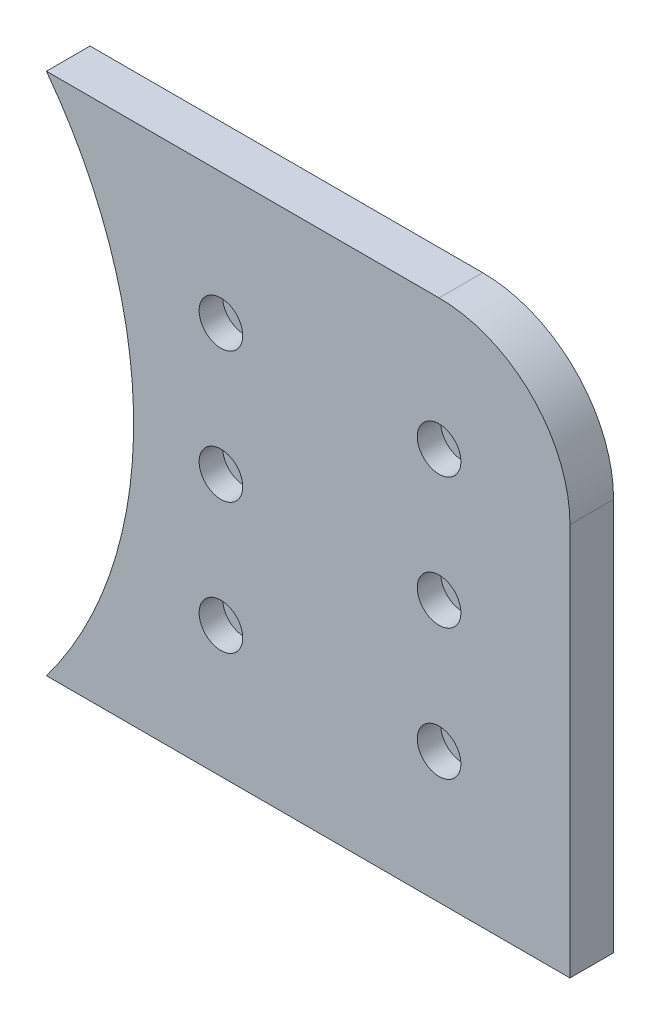
ISO-10303-21;
HEADER;
FILE_DESCRIPTION(('STEP AP214'),'2;1');
FILE_NAME('part.step','',(''),(''),'','','');
FILE_SCHEMA(('AUTOMOTIVE_DESIGN { 1 0 10303 214 1 1 1 1 }'));
ENDSEC;
DATA;
#1=APPLICATION_CONTEXT('core data for automotive mechanical design processes');
#2=APPLICATION_PROTOCOL_DEFINITION('international standard','automotive_design',2000,#1);
#3=PRODUCT_CONTEXT('',#1,'mechanical');
#4=PRODUCT('Part','Part','',(#3));
#5=PRODUCT_RELATED_PRODUCT_CATEGORY('part','',(#4));
#6=PRODUCT_DEFINITION_FORMATION('','',#4);
#7=PRODUCT_DEFINITION_CONTEXT('part definition',#1,'design');
#8=PRODUCT_DEFINITION('design','',#6,#7);
#9=PRODUCT_DEFINITION_SHAPE('','',#8);
#10=(LENGTH_UNIT() NAMED_UNIT(*) SI_UNIT(.MILLI.,.METRE.));
#11=(NAMED_UNIT(*) PLANE_ANGLE_UNIT() SI_UNIT($,.RADIAN.));
#12=(NAMED_UNIT(*) SI_UNIT($,.STERADIAN.) SOLID_ANGLE_UNIT());
#13=UNCERTAINTY_MEASURE_WITH_UNIT(LENGTH_MEASURE(1.E-05),#10,'distance_accuracy_value','');
#14=(GEOMETRIC_REPRESENTATION_CONTEXT(3) GLOBAL_UNCERTAINTY_ASSIGNED_CONTEXT((#13)) GLOBAL_UNIT_ASSIGNED_CONTEXT((#10,
#11,#12)) REPRESENTATION_CONTEXT('',''));
#15=CARTESIAN_POINT('',(0.,0.,0.));
#16=DIRECTION('',(0.,0.,1.));
#17=DIRECTION('',(1.,0.,0.));
#18=AXIS2_PLACEMENT_3D('',#15,#16,#17);
#19=CARTESIAN_POINT('',(-200.,0.,5.));
#20=DIRECTION('',(0.,0.,-1.));
#21=DIRECTION('',(-1.,0.,0.));
#22=AXIS2_PLACEMENT_3D('',#19,#20,#21);
#23=CYLINDRICAL_SURFACE('',#22,100.);
#24=CARTESIAN_POINT('',(-200.,0.,-5.));
#25=DIRECTION('',(0.,0.,-1.));
#26=DIRECTION('',(-1.,0.,0.));
#27=AXIS2_PLACEMENT_3D('',#24,#25,#26);
#28=CIRCLE('',#27,100.);
#29=CARTESIAN_POINT('',(-120.,60.,-5.));
#30=VERTEX_POINT('',#29);
#31=CARTESIAN_POINT('',(-120.,-60.,-5.));
#32=VERTEX_POINT('',#31);
#33=EDGE_CURVE('E105',#30,#32,#28,.T.);
#34=ORIENTED_EDGE('',*,*,#33,.T.);
#35=DIRECTION('',(0.,0.,-1.));
#36=VECTOR('',#35,1.);
#37=CARTESIAN_POINT('',(-120.,-60.,5.));
#38=LINE('',#37,#36);
#39=CARTESIAN_POINT('',(-120.,-60.,5.));
#40=VERTEX_POINT('',#39);
#41=EDGE_CURVE('E86',#40,#32,#38,.T.);
#42=ORIENTED_EDGE('',*,*,#41,.F.);
#43=CARTESIAN_POINT('',(-200.,0.,5.));
#44=DIRECTION('',(0.,0.,-1.));
#45=DIRECTION('',(-1.,0.,0.));
#46=AXIS2_PLACEMENT_3D('',#43,#44,#45);
#47=CIRCLE('',#46,100.);
#48=CARTESIAN_POINT('',(-120.,60.,5.));
#49=VERTEX_POINT('',#48);
#50=EDGE_CURVE('E92',#49,#40,#47,.T.);
#51=ORIENTED_EDGE('',*,*,#50,.F.);
#52=DIRECTION('',(0.,0.,-1.));
#53=VECTOR('',#52,1.);
#54=CARTESIAN_POINT('',(-120.,60.,5.));
#55=LINE('',#54,#53);
#56=EDGE_CURVE('E110',#49,#30,#55,.T.);
#57=ORIENTED_EDGE('',*,*,#56,.T.);
#58=EDGE_LOOP('',(#34,#42,#51,#57));
#59=FACE_BOUND('',#58,.T.);
#60=ADVANCED_FACE('F33',(#59),#23,.F.);
#61=CARTESIAN_POINT('',(-120.,-60.,5.));
#62=DIRECTION('',(0.,1.,0.));
#63=DIRECTION('',(0.,0.,1.));
#64=AXIS2_PLACEMENT_3D('',#61,#62,#63);
#65=PLANE('',#64);
#66=DIRECTION('',(1.,0.,0.));
#67=VECTOR('',#66,1.);
#68=CARTESIAN_POINT('',(-120.,-60.,-5.));
#69=LINE('',#68,#67);
#70=CARTESIAN_POINT('',(0.,-60.,-5.));
#71=VERTEX_POINT('',#70);
#72=EDGE_CURVE('E375',#32,#71,#69,.T.);
#73=ORIENTED_EDGE('',*,*,#72,.T.);
#74=DIRECTION('',(0.,0.,-1.));
#75=VECTOR('',#74,1.);
#76=CARTESIAN_POINT('',(0.,-60.,5.));
#77=LINE('',#76,#75);
#78=CARTESIAN_POINT('',(0.,-60.,5.));
#79=VERTEX_POINT('',#78);
#80=EDGE_CURVE('E89',#79,#71,#77,.T.);
#81=ORIENTED_EDGE('',*,*,#80,.F.);
#82=DIRECTION('',(1.,0.,0.));
#83=VECTOR('',#82,1.);
#84=CARTESIAN_POINT('',(-120.,-60.,5.));
#85=LINE('',#84,#83);
#86=EDGE_CURVE('E82',#40,#79,#85,.T.);
#87=ORIENTED_EDGE('',*,*,#86,.F.);
#88=ORIENTED_EDGE('',*,*,#41,.T.);
#89=EDGE_LOOP('',(#73,#81,#87,#88));
#90=FACE_BOUND('',#89,.T.);
#91=ADVANCED_FACE('F84',(#90),#65,.F.);
#92=CARTESIAN_POINT('',(0.,60.,5.));
#93=DIRECTION('',(-1.,0.,0.));
#94=DIRECTION('',(0.,0.,1.));
#95=AXIS2_PLACEMENT_3D('',#92,#93,#94);
#96=PLANE('',#95);
#97=DIRECTION('',(0.,1.,0.));
#98=VECTOR('',#97,1.);
#99=CARTESIAN_POINT('',(0.,60.,-5.));
#100=LINE('',#99,#98);
#101=CARTESIAN_POINT('',(0.,30.,-5.));
#102=VERTEX_POINT('',#101);
#103=EDGE_CURVE('E374',#71,#102,#100,.T.);
#104=ORIENTED_EDGE('',*,*,#103,.T.);
#105=DIRECTION('',(0.,0.,-1.));
#106=VECTOR('',#105,1.);
#107=CARTESIAN_POINT('',(0.,30.,5.));
#108=LINE('',#107,#106);
#109=CARTESIAN_POINT('',(0.,30.,5.));
#110=VERTEX_POINT('',#109);
#111=EDGE_CURVE('E48',#102,#110,#108,.F.);
#112=ORIENTED_EDGE('',*,*,#111,.T.);
#113=DIRECTION('',(0.,1.,0.));
#114=VECTOR('',#113,1.);
#115=CARTESIAN_POINT('',(0.,60.,5.));
#116=LINE('',#115,#114);
#117=EDGE_CURVE('E91',#79,#110,#116,.T.);
#118=ORIENTED_EDGE('',*,*,#117,.F.);
#119=ORIENTED_EDGE('',*,*,#80,.T.);
#120=EDGE_LOOP('',(#104,#112,#118,#119));
#121=FACE_BOUND('',#120,.T.);
#122=ADVANCED_FACE('F186',(#121),#96,.F.);
#123=CARTESIAN_POINT('',(-120.,60.,5.));
#124=DIRECTION('',(0.,-1.,0.));
#125=DIRECTION('',(0.,0.,-1.));
#126=AXIS2_PLACEMENT_3D('',#123,#124,#125);
#127=PLANE('',#126);
#128=DIRECTION('',(-1.,0.,0.));
#129=VECTOR('',#128,1.);
#130=CARTESIAN_POINT('',(-120.,60.,5.));
#131=LINE('',#130,#129);
#132=CARTESIAN_POINT('',(-30.,60.,5.));
#133=VERTEX_POINT('',#132);
#134=EDGE_CURVE('E98',#133,#49,#131,.T.);
#135=ORIENTED_EDGE('',*,*,#134,.F.);
#136=DIRECTION('',(0.,0.,-1.));
#137=VECTOR('',#136,1.);
#138=CARTESIAN_POINT('',(-30.,60.,5.));
#139=LINE('',#138,#137);
#140=CARTESIAN_POINT('',(-30.,60.,-5.));
#141=VERTEX_POINT('',#140);
#142=EDGE_CURVE('E106',#133,#141,#139,.T.);
#143=ORIENTED_EDGE('',*,*,#142,.T.);
#144=DIRECTION('',(-1.,0.,0.));
#145=VECTOR('',#144,1.);
#146=CARTESIAN_POINT('',(-120.,60.,-5.));
#147=LINE('',#146,#145);
#148=EDGE_CURVE('E102',#141,#30,#147,.T.);
#149=ORIENTED_EDGE('',*,*,#148,.T.);
#150=ORIENTED_EDGE('',*,*,#56,.F.);
#151=EDGE_LOOP('',(#135,#143,#149,#150));
#152=FACE_BOUND('',#151,.T.);
#153=ADVANCED_FACE('F176',(#152),#127,.F.);
#154=CARTESIAN_POINT('',(-200.,0.,5.));
#155=DIRECTION('',(0.,0.,-1.));
#156=DIRECTION('',(-1.,0.,0.));
#157=AXIS2_PLACEMENT_3D('',#154,#155,#156);
#158=PLANE('',#157);
#159=CARTESIAN_POINT('',(-30.,0.,5.));
#160=DIRECTION('',(0.,0.,1.));
#161=DIRECTION('',(1.,0.,0.));
#162=AXIS2_PLACEMENT_3D('',#159,#160,#161);
#163=CIRCLE('',#162,5.);
#164=CARTESIAN_POINT('',(-25.,0.,5.));
#165=VERTEX_POINT('',#164);
#166=EDGE_CURVE('E434',#165,#165,#163,.T.);
#167=ORIENTED_EDGE('',*,*,#166,.F.);
#168=EDGE_LOOP('',(#167));
#169=FACE_BOUND('',#168,.T.);
#170=CARTESIAN_POINT('',(-30.,30.,5.));
#171=DIRECTION('',(0.,0.,1.));
#172=DIRECTION('',(1.,0.,0.));
#173=AXIS2_PLACEMENT_3D('',#170,#171,#172);
#174=CIRCLE('',#173,5.);
#175=CARTESIAN_POINT('',(-25.,30.,5.));
#176=VERTEX_POINT('',#175);
#177=EDGE_CURVE('E422',#176,#176,#174,.T.);
#178=ORIENTED_EDGE('',*,*,#177,.F.);
#179=EDGE_LOOP('',(#178));
#180=FACE_BOUND('',#179,.T.);
#181=ORIENTED_EDGE('',*,*,#117,.T.);
#182=CARTESIAN_POINT('',(-30.,30.,5.));
#183=DIRECTION('',(0.,0.,-1.));
#184=DIRECTION('',(-1.,0.,0.));
#185=AXIS2_PLACEMENT_3D('',#182,#183,#184);
#186=CIRCLE('',#185,30.);
#187=EDGE_CURVE('E116',#110,#133,#186,.F.);
#188=ORIENTED_EDGE('',*,*,#187,.T.);
#189=ORIENTED_EDGE('',*,*,#134,.T.);
#190=ORIENTED_EDGE('',*,*,#50,.T.);
#191=ORIENTED_EDGE('',*,*,#86,.T.);
#192=EDGE_LOOP('',(#181,#188,#189,#190,#191));
#193=FACE_BOUND('',#192,.T.);
#194=CARTESIAN_POINT('',(-30.,-30.,5.));
#195=DIRECTION('',(0.,0.,1.));
#196=DIRECTION('',(1.,0.,0.));
#197=AXIS2_PLACEMENT_3D('',#194,#195,#196);
#198=CIRCLE('',#197,5.);
#199=CARTESIAN_POINT('',(-25.,-30.,5.));
#200=VERTEX_POINT('',#199);
#201=EDGE_CURVE('E118',#200,#200,#198,.T.);
#202=ORIENTED_EDGE('',*,*,#201,.F.);
#203=EDGE_LOOP('',(#202));
#204=FACE_BOUND('',#203,.T.);
#205=CARTESIAN_POINT('',(-80.,30.,5.));
#206=DIRECTION('',(0.,0.,1.));
#207=DIRECTION('',(1.,0.,0.));
#208=AXIS2_PLACEMENT_3D('',#205,#206,#207);
#209=CIRCLE('',#208,5.);
#210=CARTESIAN_POINT('',(-75.,30.,5.));
#211=VERTEX_POINT('',#210);
#212=EDGE_CURVE('E130',#211,#211,#209,.T.);
#213=ORIENTED_EDGE('',*,*,#212,.F.);
#214=EDGE_LOOP('',(#213));
#215=FACE_BOUND('',#214,.T.);
#216=CARTESIAN_POINT('',(-80.,0.,5.));
#217=DIRECTION('',(0.,0.,1.));
#218=DIRECTION('',(1.,0.,0.));
#219=AXIS2_PLACEMENT_3D('',#216,#217,#218);
#220=CIRCLE('',#219,5.);
#221=CARTESIAN_POINT('',(-75.,0.,5.));
#222=VERTEX_POINT('',#221);
#223=EDGE_CURVE('E142',#222,#222,#220,.T.);
#224=ORIENTED_EDGE('',*,*,#223,.F.);
#225=EDGE_LOOP('',(#224));
#226=FACE_BOUND('',#225,.T.);
#227=CARTESIAN_POINT('',(-80.,-30.,5.));
#228=DIRECTION('',(0.,0.,1.));
#229=DIRECTION('',(1.,0.,0.));
#230=AXIS2_PLACEMENT_3D('',#227,#228,#229);
#231=CIRCLE('',#230,5.);
#232=CARTESIAN_POINT('',(-75.,-30.,5.));
#233=VERTEX_POINT('',#232);
#234=EDGE_CURVE('E154',#233,#233,#231,.T.);
#235=ORIENTED_EDGE('',*,*,#234,.F.);
#236=EDGE_LOOP('',(#235));
#237=FACE_BOUND('',#236,.T.);
#238=ADVANCED_FACE('F95',(#169,#180,#193,#204,#215,#226,#237),#158,.F.);
#239=CARTESIAN_POINT('',(-200.,0.,-5.));
#240=DIRECTION('',(0.,0.,-1.));
#241=DIRECTION('',(-1.,0.,0.));
#242=AXIS2_PLACEMENT_3D('',#239,#240,#241);
#243=PLANE('',#242);
#244=CARTESIAN_POINT('',(-30.,0.,-5.));
#245=DIRECTION('',(0.,0.,1.));
#246=DIRECTION('',(1.,0.,0.));
#247=AXIS2_PLACEMENT_3D('',#244,#245,#246);
#248=CIRCLE('',#247,2.65);
#249=CARTESIAN_POINT('',(-27.35,0.,-5.));
#250=VERTEX_POINT('',#249);
#251=EDGE_CURVE('E431',#250,#250,#248,.T.);
#252=ORIENTED_EDGE('',*,*,#251,.T.);
#253=EDGE_LOOP('',(#252));
#254=FACE_BOUND('',#253,.T.);
#255=CARTESIAN_POINT('',(-30.,30.,-5.));
#256=DIRECTION('',(0.,0.,1.));
#257=DIRECTION('',(1.,0.,0.));
#258=AXIS2_PLACEMENT_3D('',#255,#256,#257);
#259=CIRCLE('',#258,2.65);
#260=CARTESIAN_POINT('',(-27.35,30.,-5.));
#261=VERTEX_POINT('',#260);
#262=EDGE_CURVE('E383',#261,#261,#259,.T.);
#263=ORIENTED_EDGE('',*,*,#262,.T.);
#264=EDGE_LOOP('',(#263));
#265=FACE_BOUND('',#264,.T.);
#266=ORIENTED_EDGE('',*,*,#148,.F.);
#267=CARTESIAN_POINT('',(-30.,30.,-5.));
#268=DIRECTION('',(0.,0.,-1.));
#269=DIRECTION('',(-1.,0.,0.));
#270=AXIS2_PLACEMENT_3D('',#267,#268,#269);
#271=CIRCLE('',#270,30.);
#272=EDGE_CURVE('E56',#141,#102,#271,.T.);
#273=ORIENTED_EDGE('',*,*,#272,.T.);
#274=ORIENTED_EDGE('',*,*,#103,.F.);
#275=ORIENTED_EDGE('',*,*,#72,.F.);
#276=ORIENTED_EDGE('',*,*,#33,.F.);
#277=EDGE_LOOP('',(#266,#273,#274,#275,#276));
#278=FACE_BOUND('',#277,.T.);
#279=CARTESIAN_POINT('',(-30.,-30.,-5.));
#280=DIRECTION('',(0.,0.,1.));
#281=DIRECTION('',(1.,0.,0.));
#282=AXIS2_PLACEMENT_3D('',#279,#280,#281);
#283=CIRCLE('',#282,2.65);
#284=CARTESIAN_POINT('',(-27.35,-30.,-5.));
#285=VERTEX_POINT('',#284);
#286=EDGE_CURVE('E121',#285,#285,#283,.T.);
#287=ORIENTED_EDGE('',*,*,#286,.T.);
#288=EDGE_LOOP('',(#287));
#289=FACE_BOUND('',#288,.T.);
#290=CARTESIAN_POINT('',(-80.,30.,-5.));
#291=DIRECTION('',(0.,0.,1.));
#292=DIRECTION('',(1.,0.,0.));
#293=AXIS2_PLACEMENT_3D('',#290,#291,#292);
#294=CIRCLE('',#293,2.65);
#295=CARTESIAN_POINT('',(-77.35,30.,-5.));
#296=VERTEX_POINT('',#295);
#297=EDGE_CURVE('E133',#296,#296,#294,.T.);
#298=ORIENTED_EDGE('',*,*,#297,.T.);
#299=EDGE_LOOP('',(#298));
#300=FACE_BOUND('',#299,.T.);
#301=CARTESIAN_POINT('',(-80.,0.,-5.));
#302=DIRECTION('',(0.,0.,1.));
#303=DIRECTION('',(1.,0.,0.));
#304=AXIS2_PLACEMENT_3D('',#301,#302,#303);
#305=CIRCLE('',#304,2.65);
#306=CARTESIAN_POINT('',(-77.35,0.,-5.));
#307=VERTEX_POINT('',#306);
#308=EDGE_CURVE('E145',#307,#307,#305,.T.);
#309=ORIENTED_EDGE('',*,*,#308,.T.);
#310=EDGE_LOOP('',(#309));
#311=FACE_BOUND('',#310,.T.);
#312=CARTESIAN_POINT('',(-80.,-30.,-5.));
#313=DIRECTION('',(0.,0.,1.));
#314=DIRECTION('',(1.,0.,0.));
#315=AXIS2_PLACEMENT_3D('',#312,#313,#314);
#316=CIRCLE('',#315,2.65);
#317=CARTESIAN_POINT('',(-77.35,-30.,-5.));
#318=VERTEX_POINT('',#317);
#319=EDGE_CURVE('E157',#318,#318,#316,.T.);
#320=ORIENTED_EDGE('',*,*,#319,.T.);
#321=EDGE_LOOP('',(#320));
#322=FACE_BOUND('',#321,.T.);
#323=ADVANCED_FACE('F175',(#254,#265,#278,#289,#300,#311,#322),#243,.T.);
#324=CARTESIAN_POINT('',(-30.,30.,5.));
#325=DIRECTION('',(0.,0.,-1.));
#326=DIRECTION('',(-1.,0.,0.));
#327=AXIS2_PLACEMENT_3D('',#324,#325,#326);
#328=CYLINDRICAL_SURFACE('',#327,30.);
#329=ORIENTED_EDGE('',*,*,#187,.F.);
#330=ORIENTED_EDGE('',*,*,#111,.F.);
#331=ORIENTED_EDGE('',*,*,#272,.F.);
#332=ORIENTED_EDGE('',*,*,#142,.F.);
#333=EDGE_LOOP('',(#329,#330,#331,#332));
#334=FACE_BOUND('',#333,.T.);
#335=ADVANCED_FACE('F183',(#334),#328,.T.);
#336=CARTESIAN_POINT('',(-30.,30.,5.));
#337=DIRECTION('',(0.,0.,1.));
#338=DIRECTION('',(1.,0.,0.));
#339=AXIS2_PLACEMENT_3D('',#336,#337,#338);
#340=CYLINDRICAL_SURFACE('',#339,2.65);
#341=ORIENTED_EDGE('',*,*,#262,.F.);
#342=EDGE_LOOP('',(#341));
#343=FACE_BOUND('',#342,.T.);
#344=CARTESIAN_POINT('',(-30.,30.,-0.4));
#345=DIRECTION('',(0.,0.,1.));
#346=DIRECTION('',(1.,0.,0.));
#347=AXIS2_PLACEMENT_3D('',#344,#345,#346);
#348=CIRCLE('',#347,2.65);
#349=CARTESIAN_POINT('',(-27.35,30.,-0.4));
#350=VERTEX_POINT('',#349);
#351=EDGE_CURVE('E412',#350,#350,#348,.T.);
#352=ORIENTED_EDGE('',*,*,#351,.T.);
#353=EDGE_LOOP('',(#352));
#354=FACE_BOUND('',#353,.T.);
#355=ADVANCED_FACE('F202',(#343,#354),#340,.F.);
#356=CARTESIAN_POINT('',(-27.35,30.,-0.4));
#357=DIRECTION('',(0.,0.,-1.));
#358=DIRECTION('',(-1.,0.,0.));
#359=AXIS2_PLACEMENT_3D('',#356,#357,#358);
#360=PLANE('',#359);
#361=ORIENTED_EDGE('',*,*,#351,.F.);
#362=EDGE_LOOP('',(#361));
#363=FACE_BOUND('',#362,.T.);
#364=CARTESIAN_POINT('',(-30.,30.,-0.4));
#365=DIRECTION('',(0.,0.,1.));
#366=DIRECTION('',(1.,0.,0.));
#367=AXIS2_PLACEMENT_3D('',#364,#365,#366);
#368=CIRCLE('',#367,5.);
#369=CARTESIAN_POINT('',(-25.,30.,-0.4));
#370=VERTEX_POINT('',#369);
#371=EDGE_CURVE('E417',#370,#370,#368,.T.);
#372=ORIENTED_EDGE('',*,*,#371,.T.);
#373=EDGE_LOOP('',(#372));
#374=FACE_BOUND('',#373,.T.);
#375=ADVANCED_FACE('F321',(#363,#374),#360,.F.);
#376=CARTESIAN_POINT('',(-30.,30.,5.));
#377=DIRECTION('',(0.,0.,1.));
#378=DIRECTION('',(1.,0.,0.));
#379=AXIS2_PLACEMENT_3D('',#376,#377,#378);
#380=CYLINDRICAL_SURFACE('',#379,5.);
#381=ORIENTED_EDGE('',*,*,#371,.F.);
#382=EDGE_LOOP('',(#381));
#383=FACE_BOUND('',#382,.T.);
#384=ORIENTED_EDGE('',*,*,#177,.T.);
#385=EDGE_LOOP('',(#384));
#386=FACE_BOUND('',#385,.T.);
#387=ADVANCED_FACE('F312',(#383,#386),#380,.F.);
#388=CARTESIAN_POINT('',(-30.,0.,5.));
#389=DIRECTION('',(0.,0.,1.));
#390=DIRECTION('',(1.,0.,0.));
#391=AXIS2_PLACEMENT_3D('',#388,#389,#390);
#392=CYLINDRICAL_SURFACE('',#391,2.65);
#393=ORIENTED_EDGE('',*,*,#251,.F.);
#394=EDGE_LOOP('',(#393));
#395=FACE_BOUND('',#394,.T.);
#396=CARTESIAN_POINT('',(-30.,0.,-0.4));
#397=DIRECTION('',(0.,0.,1.));
#398=DIRECTION('',(1.,0.,0.));
#399=AXIS2_PLACEMENT_3D('',#396,#397,#398);
#400=CIRCLE('',#399,2.65);
#401=CARTESIAN_POINT('',(-27.35,0.,-0.4));
#402=VERTEX_POINT('',#401);
#403=EDGE_CURVE('E425',#402,#402,#400,.T.);
#404=ORIENTED_EDGE('',*,*,#403,.T.);
#405=EDGE_LOOP('',(#404));
#406=FACE_BOUND('',#405,.T.);
#407=ADVANCED_FACE('F304',(#395,#406),#392,.F.);
#408=CARTESIAN_POINT('',(-27.35,0.,-0.4));
#409=DIRECTION('',(0.,0.,-1.));
#410=DIRECTION('',(-1.,0.,0.));
#411=AXIS2_PLACEMENT_3D('',#408,#409,#410);
#412=PLANE('',#411);
#413=ORIENTED_EDGE('',*,*,#403,.F.);
#414=EDGE_LOOP('',(#413));
#415=FACE_BOUND('',#414,.T.);
#416=CARTESIAN_POINT('',(-30.,0.,-0.4));
#417=DIRECTION('',(0.,0.,1.));
#418=DIRECTION('',(1.,0.,0.));
#419=AXIS2_PLACEMENT_3D('',#416,#417,#418);
#420=CIRCLE('',#419,5.);
#421=CARTESIAN_POINT('',(-25.,0.,-0.4));
#422=VERTEX_POINT('',#421);
#423=EDGE_CURVE('E428',#422,#422,#420,.T.);
#424=ORIENTED_EDGE('',*,*,#423,.T.);
#425=EDGE_LOOP('',(#424));
#426=FACE_BOUND('',#425,.T.);
#427=ADVANCED_FACE('F296',(#415,#426),#412,.F.);
#428=CARTESIAN_POINT('',(-30.,0.,5.));
#429=DIRECTION('',(0.,0.,1.));
#430=DIRECTION('',(1.,0.,0.));
#431=AXIS2_PLACEMENT_3D('',#428,#429,#430);
#432=CYLINDRICAL_SURFACE('',#431,5.);
#433=ORIENTED_EDGE('',*,*,#423,.F.);
#434=EDGE_LOOP('',(#433));
#435=FACE_BOUND('',#434,.T.);
#436=ORIENTED_EDGE('',*,*,#166,.T.);
#437=EDGE_LOOP('',(#436));
#438=FACE_BOUND('',#437,.T.);
#439=ADVANCED_FACE('F216',(#435,#438),#432,.F.);
#440=CARTESIAN_POINT('',(-30.,-30.,5.));
#441=DIRECTION('',(0.,0.,1.));
#442=DIRECTION('',(1.,0.,0.));
#443=AXIS2_PLACEMENT_3D('',#440,#441,#442);
#444=CYLINDRICAL_SURFACE('',#443,5.);
#445=CARTESIAN_POINT('',(-30.,-30.,-0.4));
#446=DIRECTION('',(0.,0.,1.));
#447=DIRECTION('',(1.,0.,0.));
#448=AXIS2_PLACEMENT_3D('',#445,#446,#447);
#449=CIRCLE('',#448,5.);
#450=CARTESIAN_POINT('',(-25.,-30.,-0.4));
#451=VERTEX_POINT('',#450);
#452=EDGE_CURVE('E127',#451,#451,#449,.T.);
#453=ORIENTED_EDGE('',*,*,#452,.F.);
#454=EDGE_LOOP('',(#453));
#455=FACE_BOUND('',#454,.T.);
#456=ORIENTED_EDGE('',*,*,#201,.T.);
#457=EDGE_LOOP('',(#456));
#458=FACE_BOUND('',#457,.T.);
#459=ADVANCED_FACE('F212',(#455,#458),#444,.F.);
#460=CARTESIAN_POINT('',(-27.35,-30.,-0.4));
#461=DIRECTION('',(0.,0.,-1.));
#462=DIRECTION('',(-1.,0.,0.));
#463=AXIS2_PLACEMENT_3D('',#460,#461,#462);
#464=PLANE('',#463);
#465=CARTESIAN_POINT('',(-30.,-30.,-0.4));
#466=DIRECTION('',(0.,0.,1.));
#467=DIRECTION('',(1.,0.,0.));
#468=AXIS2_PLACEMENT_3D('',#465,#466,#467);
#469=CIRCLE('',#468,2.65);
#470=CARTESIAN_POINT('',(-27.35,-30.,-0.4));
#471=VERTEX_POINT('',#470);
#472=EDGE_CURVE('E124',#471,#471,#469,.T.);
#473=ORIENTED_EDGE('',*,*,#472,.F.);
#474=EDGE_LOOP('',(#473));
#475=FACE_BOUND('',#474,.T.);
#476=ORIENTED_EDGE('',*,*,#452,.T.);
#477=EDGE_LOOP('',(#476));
#478=FACE_BOUND('',#477,.T.);
#479=ADVANCED_FACE('F208',(#475,#478),#464,.F.);
#480=CARTESIAN_POINT('',(-30.,-30.,5.));
#481=DIRECTION('',(0.,0.,1.));
#482=DIRECTION('',(1.,0.,0.));
#483=AXIS2_PLACEMENT_3D('',#480,#481,#482);
#484=CYLINDRICAL_SURFACE('',#483,2.65);
#485=ORIENTED_EDGE('',*,*,#286,.F.);
#486=EDGE_LOOP('',(#485));
#487=FACE_BOUND('',#486,.T.);
#488=ORIENTED_EDGE('',*,*,#472,.T.);
#489=EDGE_LOOP('',(#488));
#490=FACE_BOUND('',#489,.T.);
#491=ADVANCED_FACE('F204',(#487,#490),#484,.F.);
#492=CARTESIAN_POINT('',(-80.,30.,5.));
#493=DIRECTION('',(0.,0.,1.));
#494=DIRECTION('',(1.,0.,0.));
#495=AXIS2_PLACEMENT_3D('',#492,#493,#494);
#496=CYLINDRICAL_SURFACE('',#495,5.);
#497=CARTESIAN_POINT('',(-80.,30.,-0.4));
#498=DIRECTION('',(0.,0.,1.));
#499=DIRECTION('',(1.,0.,0.));
#500=AXIS2_PLACEMENT_3D('',#497,#498,#499);
#501=CIRCLE('',#500,5.);
#502=CARTESIAN_POINT('',(-75.,30.,-0.4));
#503=VERTEX_POINT('',#502);
#504=EDGE_CURVE('E139',#503,#503,#501,.T.);
#505=ORIENTED_EDGE('',*,*,#504,.F.);
#506=EDGE_LOOP('',(#505));
#507=FACE_BOUND('',#506,.T.);
#508=ORIENTED_EDGE('',*,*,#212,.T.);
#509=EDGE_LOOP('',(#508));
#510=FACE_BOUND('',#509,.T.);
#511=ADVANCED_FACE('F207',(#507,#510),#496,.F.);
#512=CARTESIAN_POINT('',(-77.35,30.,-0.4));
#513=DIRECTION('',(0.,0.,-1.));
#514=DIRECTION('',(-1.,0.,0.));
#515=AXIS2_PLACEMENT_3D('',#512,#513,#514);
#516=PLANE('',#515);
#517=CARTESIAN_POINT('',(-80.,30.,-0.4));
#518=DIRECTION('',(0.,0.,1.));
#519=DIRECTION('',(1.,0.,0.));
#520=AXIS2_PLACEMENT_3D('',#517,#518,#519);
#521=CIRCLE('',#520,2.65);
#522=CARTESIAN_POINT('',(-77.35,30.,-0.4));
#523=VERTEX_POINT('',#522);
#524=EDGE_CURVE('E136',#523,#523,#521,.T.);
#525=ORIENTED_EDGE('',*,*,#524,.F.);
#526=EDGE_LOOP('',(#525));
#527=FACE_BOUND('',#526,.T.);
#528=ORIENTED_EDGE('',*,*,#504,.T.);
#529=EDGE_LOOP('',(#528));
#530=FACE_BOUND('',#529,.T.);
#531=ADVANCED_FACE('F222',(#527,#530),#516,.F.);
#532=CARTESIAN_POINT('',(-80.,30.,5.));
#533=DIRECTION('',(0.,0.,1.));
#534=DIRECTION('',(1.,0.,0.));
#535=AXIS2_PLACEMENT_3D('',#532,#533,#534);
#536=CYLINDRICAL_SURFACE('',#535,2.65);
#537=ORIENTED_EDGE('',*,*,#297,.F.);
#538=EDGE_LOOP('',(#537));
#539=FACE_BOUND('',#538,.T.);
#540=ORIENTED_EDGE('',*,*,#524,.T.);
#541=EDGE_LOOP('',(#540));
#542=FACE_BOUND('',#541,.T.);
#543=ADVANCED_FACE('F218',(#539,#542),#536,.F.);
#544=CARTESIAN_POINT('',(-80.,0.,5.));
#545=DIRECTION('',(0.,0.,1.));
#546=DIRECTION('',(1.,0.,0.));
#547=AXIS2_PLACEMENT_3D('',#544,#545,#546);
#548=CYLINDRICAL_SURFACE('',#547,5.);
#549=CARTESIAN_POINT('',(-80.,0.,-0.4));
#550=DIRECTION('',(0.,0.,1.));
#551=DIRECTION('',(1.,0.,0.));
#552=AXIS2_PLACEMENT_3D('',#549,#550,#551);
#553=CIRCLE('',#552,5.);
#554=CARTESIAN_POINT('',(-75.,0.,-0.4));
#555=VERTEX_POINT('',#554);
#556=EDGE_CURVE('E151',#555,#555,#553,.T.);
#557=ORIENTED_EDGE('',*,*,#556,.F.);
#558=EDGE_LOOP('',(#557));
#559=FACE_BOUND('',#558,.T.);
#560=ORIENTED_EDGE('',*,*,#223,.T.);
#561=EDGE_LOOP('',(#560));
#562=FACE_BOUND('',#561,.T.);
#563=ADVANCED_FACE('F221',(#559,#562),#548,.F.);
#564=CARTESIAN_POINT('',(-77.35,0.,-0.4));
#565=DIRECTION('',(0.,0.,-1.));
#566=DIRECTION('',(-1.,0.,0.));
#567=AXIS2_PLACEMENT_3D('',#564,#565,#566);
#568=PLANE('',#567);
#569=CARTESIAN_POINT('',(-80.,0.,-0.4));
#570=DIRECTION('',(0.,0.,1.));
#571=DIRECTION('',(1.,0.,0.));
#572=AXIS2_PLACEMENT_3D('',#569,#570,#571);
#573=CIRCLE('',#572,2.65);
#574=CARTESIAN_POINT('',(-77.35,0.,-0.4));
#575=VERTEX_POINT('',#574);
#576=EDGE_CURVE('E148',#575,#575,#573,.T.);
#577=ORIENTED_EDGE('',*,*,#576,.F.);
#578=EDGE_LOOP('',(#577));
#579=FACE_BOUND('',#578,.T.);
#580=ORIENTED_EDGE('',*,*,#556,.T.);
#581=EDGE_LOOP('',(#580));
#582=FACE_BOUND('',#581,.T.);
#583=ADVANCED_FACE('F232',(#579,#582),#568,.F.);
#584=CARTESIAN_POINT('',(-80.,0.,5.));
#585=DIRECTION('',(0.,0.,1.));
#586=DIRECTION('',(1.,0.,0.));
#587=AXIS2_PLACEMENT_3D('',#584,#585,#586);
#588=CYLINDRICAL_SURFACE('',#587,2.65);
#589=ORIENTED_EDGE('',*,*,#308,.F.);
#590=EDGE_LOOP('',(#589));
#591=FACE_BOUND('',#590,.T.);
#592=ORIENTED_EDGE('',*,*,#576,.T.);
#593=EDGE_LOOP('',(#592));
#594=FACE_BOUND('',#593,.T.);
#595=ADVANCED_FACE('F171',(#591,#594),#588,.F.);
#596=CARTESIAN_POINT('',(-80.,-30.,5.));
#597=DIRECTION('',(0.,0.,1.));
#598=DIRECTION('',(1.,0.,0.));
#599=AXIS2_PLACEMENT_3D('',#596,#597,#598);
#600=CYLINDRICAL_SURFACE('',#599,5.);
#601=CARTESIAN_POINT('',(-80.,-30.,-0.4));
#602=DIRECTION('',(0.,0.,1.));
#603=DIRECTION('',(1.,0.,0.));
#604=AXIS2_PLACEMENT_3D('',#601,#602,#603);
#605=CIRCLE('',#604,5.);
#606=CARTESIAN_POINT('',(-75.,-30.,-0.4));
#607=VERTEX_POINT('',#606);
#608=EDGE_CURVE('E11',#607,#607,#605,.T.);
#609=ORIENTED_EDGE('',*,*,#608,.F.);
#610=EDGE_LOOP('',(#609));
#611=FACE_BOUND('',#610,.T.);
#612=ORIENTED_EDGE('',*,*,#234,.T.);
#613=EDGE_LOOP('',(#612));
#614=FACE_BOUND('',#613,.T.);
#615=ADVANCED_FACE('F35',(#611,#614),#600,.F.);
#616=CARTESIAN_POINT('',(-77.35,-30.,-0.4));
#617=DIRECTION('',(0.,0.,-1.));
#618=DIRECTION('',(-1.,0.,0.));
#619=AXIS2_PLACEMENT_3D('',#616,#617,#618);
#620=PLANE('',#619);
#621=CARTESIAN_POINT('',(-80.,-30.,-0.4));
#622=DIRECTION('',(0.,0.,1.));
#623=DIRECTION('',(1.,0.,0.));
#624=AXIS2_PLACEMENT_3D('',#621,#622,#623);
#625=CIRCLE('',#624,2.65);
#626=CARTESIAN_POINT('',(-77.35,-30.,-0.4));
#627=VERTEX_POINT('',#626);
#628=EDGE_CURVE('E41',#627,#627,#625,.T.);
#629=ORIENTED_EDGE('',*,*,#628,.F.);
#630=EDGE_LOOP('',(#629));
#631=FACE_BOUND('',#630,.T.);
#632=ORIENTED_EDGE('',*,*,#608,.T.);
#633=EDGE_LOOP('',(#632));
#634=FACE_BOUND('',#633,.T.);
#635=ADVANCED_FACE('F164',(#631,#634),#620,.F.);
#636=CARTESIAN_POINT('',(-80.,-30.,5.));
#637=DIRECTION('',(0.,0.,1.));
#638=DIRECTION('',(1.,0.,0.));
#639=AXIS2_PLACEMENT_3D('',#636,#637,#638);
#640=CYLINDRICAL_SURFACE('',#639,2.65);
#641=ORIENTED_EDGE('',*,*,#319,.F.);
#642=EDGE_LOOP('',(#641));
#643=FACE_BOUND('',#642,.T.);
#644=ORIENTED_EDGE('',*,*,#628,.T.);
#645=EDGE_LOOP('',(#644));
#646=FACE_BOUND('',#645,.T.);
#647=ADVANCED_FACE('F162',(#643,#646),#640,.F.);
#648=CLOSED_SHELL('',(#60,#91,#122,#153,#238,#323,#335,#355,#375,#387,#407,#427,#439,#459,#479,
#491,#511,#531,#543,#563,#583,#595,#615,#635,#647));
#649=MANIFOLD_SOLID_BREP('B2',#648);
#650=ADVANCED_BREP_SHAPE_REPRESENTATION('',(#18,#649),#14);
#651=SHAPE_DEFINITION_REPRESENTATION(#9,#650);
ENDSEC;
END-ISO-10303-21;
